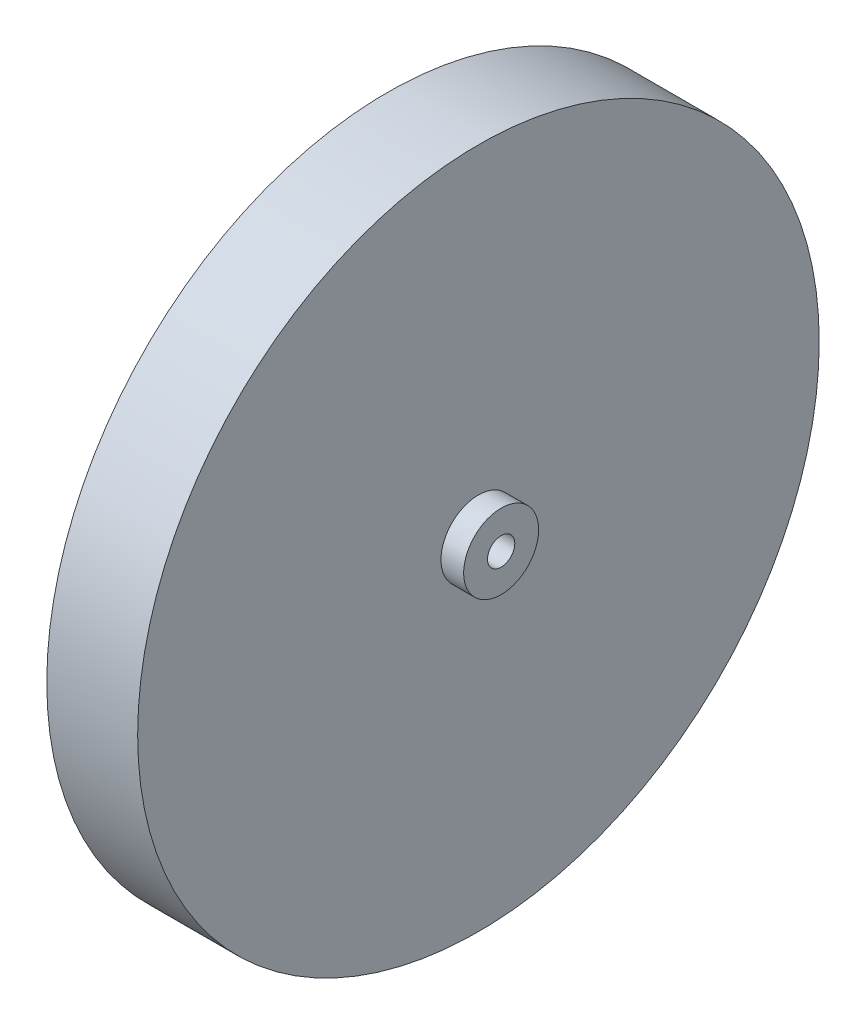
ISO-10303-21;
HEADER;
FILE_DESCRIPTION(('STEP AP214'),'2;1');
FILE_NAME('part.step','',(''),(''),'','','');
FILE_SCHEMA(('AUTOMOTIVE_DESIGN { 1 0 10303 214 1 1 1 1 }'));
ENDSEC;
DATA;
#1=APPLICATION_CONTEXT('core data for automotive mechanical design processes');
#2=APPLICATION_PROTOCOL_DEFINITION('international standard','automotive_design',2000,#1);
#3=PRODUCT_CONTEXT('',#1,'mechanical');
#4=PRODUCT('Part','Part','',(#3));
#5=PRODUCT_RELATED_PRODUCT_CATEGORY('part','',(#4));
#6=PRODUCT_DEFINITION_FORMATION('','',#4);
#7=PRODUCT_DEFINITION_CONTEXT('part definition',#1,'design');
#8=PRODUCT_DEFINITION('design','',#6,#7);
#9=PRODUCT_DEFINITION_SHAPE('','',#8);
#10=(LENGTH_UNIT() NAMED_UNIT(*) SI_UNIT(.MILLI.,.METRE.));
#11=(NAMED_UNIT(*) PLANE_ANGLE_UNIT() SI_UNIT($,.RADIAN.));
#12=(NAMED_UNIT(*) SI_UNIT($,.STERADIAN.) SOLID_ANGLE_UNIT());
#13=UNCERTAINTY_MEASURE_WITH_UNIT(LENGTH_MEASURE(1.E-05),#10,'distance_accuracy_value','');
#14=(GEOMETRIC_REPRESENTATION_CONTEXT(3) GLOBAL_UNCERTAINTY_ASSIGNED_CONTEXT((#13)) GLOBAL_UNIT_ASSIGNED_CONTEXT((#10,
#11,#12)) REPRESENTATION_CONTEXT('',''));
#15=CARTESIAN_POINT('',(0.,0.,0.));
#16=DIRECTION('',(0.,0.,1.));
#17=DIRECTION('',(1.,0.,0.));
#18=AXIS2_PLACEMENT_3D('',#15,#16,#17);
#19=CARTESIAN_POINT('',(6.35,0.,0.));
#20=DIRECTION('',(-1.,0.,0.));
#21=DIRECTION('',(0.,0.,1.));
#22=AXIS2_PLACEMENT_3D('',#19,#20,#21);
#23=PLANE('',#22);
#24=CARTESIAN_POINT('',(6.35,0.,0.));
#25=DIRECTION('',(-1.,0.,0.));
#26=DIRECTION('',(0.,0.,1.));
#27=AXIS2_PLACEMENT_3D('',#24,#25,#26);
#28=CIRCLE('',#27,12.7);
#29=CARTESIAN_POINT('',(6.35,0.,12.7));
#30=VERTEX_POINT('',#29);
#31=EDGE_CURVE('E57',#30,#30,#28,.T.);
#32=ORIENTED_EDGE('',*,*,#31,.T.);
#33=EDGE_LOOP('',(#32));
#34=FACE_BOUND('',#33,.T.);
#35=CARTESIAN_POINT('',(6.35,0.,0.));
#36=DIRECTION('',(-1.,0.,0.));
#37=DIRECTION('',(0.,0.,1.));
#38=AXIS2_PLACEMENT_3D('',#35,#36,#37);
#39=CIRCLE('',#38,6.731);
#40=CARTESIAN_POINT('',(6.35,0.,6.731));
#41=VERTEX_POINT('',#40);
#42=EDGE_CURVE('E66',#41,#41,#39,.T.);
#43=ORIENTED_EDGE('',*,*,#42,.F.);
#44=EDGE_LOOP('',(#43));
#45=FACE_BOUND('',#44,.T.);
#46=ADVANCED_FACE('F32',(#34,#45),#23,.T.);
#47=CARTESIAN_POINT('',(0.,0.,0.));
#48=DIRECTION('',(1.,0.,0.));
#49=DIRECTION('',(0.,0.,-1.));
#50=AXIS2_PLACEMENT_3D('',#47,#48,#49);
#51=CYLINDRICAL_SURFACE('',#50,1.524);
#52=CARTESIAN_POINT('',(12.7,0.,0.));
#53=DIRECTION('',(1.,0.,0.));
#54=DIRECTION('',(0.,0.,-1.));
#55=AXIS2_PLACEMENT_3D('',#52,#53,#54);
#56=CIRCLE('',#55,1.524);
#57=CARTESIAN_POINT('',(12.7,0.,-1.524));
#58=VERTEX_POINT('',#57);
#59=EDGE_CURVE('E48',#58,#58,#56,.T.);
#60=ORIENTED_EDGE('',*,*,#59,.T.);
#61=EDGE_LOOP('',(#60));
#62=FACE_BOUND('',#61,.T.);
#63=CARTESIAN_POINT('',(6.35,0.,0.));
#64=DIRECTION('',(-1.,0.,0.));
#65=DIRECTION('',(0.,0.,1.));
#66=AXIS2_PLACEMENT_3D('',#63,#64,#65);
#67=CIRCLE('',#66,1.524);
#68=CARTESIAN_POINT('',(6.35,0.,1.524));
#69=VERTEX_POINT('',#68);
#70=EDGE_CURVE('E69',#69,#69,#67,.F.);
#71=ORIENTED_EDGE('',*,*,#70,.F.);
#72=EDGE_LOOP('',(#71));
#73=FACE_BOUND('',#72,.T.);
#74=ADVANCED_FACE('F104',(#62,#73),#51,.F.);
#75=CARTESIAN_POINT('',(10.16,0.,0.));
#76=DIRECTION('',(1.,0.,0.));
#77=DIRECTION('',(0.,0.,-1.));
#78=AXIS2_PLACEMENT_3D('',#75,#76,#77);
#79=PLANE('',#78);
#80=CARTESIAN_POINT('',(10.16,0.,0.));
#81=DIRECTION('',(1.,0.,0.));
#82=DIRECTION('',(0.,0.,-1.));
#83=AXIS2_PLACEMENT_3D('',#80,#81,#82);
#84=CIRCLE('',#83,38.1);
#85=CARTESIAN_POINT('',(10.16,0.,-38.1));
#86=VERTEX_POINT('',#85);
#87=EDGE_CURVE('E10',#86,#86,#84,.T.);
#88=ORIENTED_EDGE('',*,*,#87,.T.);
#89=EDGE_LOOP('',(#88));
#90=FACE_BOUND('',#89,.T.);
#91=CARTESIAN_POINT('',(10.16,0.,0.));
#92=DIRECTION('',(1.,0.,0.));
#93=DIRECTION('',(0.,0.,-1.));
#94=AXIS2_PLACEMENT_3D('',#91,#92,#93);
#95=CIRCLE('',#94,4.191);
#96=CARTESIAN_POINT('',(10.16,0.,-4.191));
#97=VERTEX_POINT('',#96);
#98=EDGE_CURVE('E45',#97,#97,#95,.T.);
#99=ORIENTED_EDGE('',*,*,#98,.F.);
#100=EDGE_LOOP('',(#99));
#101=FACE_BOUND('',#100,.T.);
#102=ADVANCED_FACE('F110',(#90,#101),#79,.T.);
#103=CARTESIAN_POINT('',(10.16,0.,0.));
#104=DIRECTION('',(-1.,0.,0.));
#105=DIRECTION('',(0.,0.,1.));
#106=AXIS2_PLACEMENT_3D('',#103,#104,#105);
#107=CYLINDRICAL_SURFACE('',#106,38.1);
#108=ORIENTED_EDGE('',*,*,#87,.F.);
#109=EDGE_LOOP('',(#108));
#110=FACE_BOUND('',#109,.T.);
#111=CARTESIAN_POINT('',(0.,0.,0.));
#112=DIRECTION('',(1.,0.,0.));
#113=DIRECTION('',(0.,0.,-1.));
#114=AXIS2_PLACEMENT_3D('',#111,#112,#113);
#115=CIRCLE('',#114,38.1);
#116=CARTESIAN_POINT('',(0.,0.,-38.1));
#117=VERTEX_POINT('',#116);
#118=EDGE_CURVE('E36',#117,#117,#115,.T.);
#119=ORIENTED_EDGE('',*,*,#118,.T.);
#120=EDGE_LOOP('',(#119));
#121=FACE_BOUND('',#120,.T.);
#122=ADVANCED_FACE('F34',(#110,#121),#107,.T.);
#123=CARTESIAN_POINT('',(0.,0.,0.));
#124=DIRECTION('',(1.,0.,0.));
#125=DIRECTION('',(0.,0.,-1.));
#126=AXIS2_PLACEMENT_3D('',#123,#124,#125);
#127=PLANE('',#126);
#128=CARTESIAN_POINT('',(0.,0.,0.));
#129=DIRECTION('',(-1.,0.,0.));
#130=DIRECTION('',(0.,0.,1.));
#131=AXIS2_PLACEMENT_3D('',#128,#129,#130);
#132=CIRCLE('',#131,22.86);
#133=CARTESIAN_POINT('',(0.,0.,22.86));
#134=VERTEX_POINT('',#133);
#135=EDGE_CURVE('E54',#134,#134,#132,.T.);
#136=ORIENTED_EDGE('',*,*,#135,.F.);
#137=EDGE_LOOP('',(#136));
#138=FACE_BOUND('',#137,.T.);
#139=ORIENTED_EDGE('',*,*,#118,.F.);
#140=EDGE_LOOP('',(#139));
#141=FACE_BOUND('',#140,.T.);
#142=ADVANCED_FACE('F132',(#138,#141),#127,.F.);
#143=CARTESIAN_POINT('',(12.7,0.,0.));
#144=DIRECTION('',(-1.,0.,0.));
#145=DIRECTION('',(0.,0.,1.));
#146=AXIS2_PLACEMENT_3D('',#143,#144,#145);
#147=CYLINDRICAL_SURFACE('',#146,4.191);
#148=CARTESIAN_POINT('',(12.7,0.,0.));
#149=DIRECTION('',(1.,0.,0.));
#150=DIRECTION('',(0.,0.,-1.));
#151=AXIS2_PLACEMENT_3D('',#148,#149,#150);
#152=CIRCLE('',#151,4.191);
#153=CARTESIAN_POINT('',(12.7,0.,-4.191));
#154=VERTEX_POINT('',#153);
#155=EDGE_CURVE('E43',#154,#154,#152,.T.);
#156=ORIENTED_EDGE('',*,*,#155,.F.);
#157=EDGE_LOOP('',(#156));
#158=FACE_BOUND('',#157,.T.);
#159=ORIENTED_EDGE('',*,*,#98,.T.);
#160=EDGE_LOOP('',(#159));
#161=FACE_BOUND('',#160,.T.);
#162=ADVANCED_FACE('F128',(#158,#161),#147,.T.);
#163=CARTESIAN_POINT('',(12.7,0.,0.));
#164=DIRECTION('',(1.,0.,0.));
#165=DIRECTION('',(0.,0.,-1.));
#166=AXIS2_PLACEMENT_3D('',#163,#164,#165);
#167=PLANE('',#166);
#168=ORIENTED_EDGE('',*,*,#59,.F.);
#169=EDGE_LOOP('',(#168));
#170=FACE_BOUND('',#169,.T.);
#171=ORIENTED_EDGE('',*,*,#155,.T.);
#172=EDGE_LOOP('',(#171));
#173=FACE_BOUND('',#172,.T.);
#174=ADVANCED_FACE('F121',(#170,#173),#167,.T.);
#175=CARTESIAN_POINT('',(3.81,0.,0.));
#176=DIRECTION('',(-1.,0.,0.));
#177=DIRECTION('',(0.,0.,1.));
#178=AXIS2_PLACEMENT_3D('',#175,#176,#177);
#179=PLANE('',#178);
#180=CARTESIAN_POINT('',(3.81,0.,0.));
#181=DIRECTION('',(-1.,0.,0.));
#182=DIRECTION('',(0.,0.,1.));
#183=AXIS2_PLACEMENT_3D('',#180,#181,#182);
#184=CIRCLE('',#183,12.7);
#185=CARTESIAN_POINT('',(3.81,0.,12.7));
#186=VERTEX_POINT('',#185);
#187=EDGE_CURVE('E60',#186,#186,#184,.T.);
#188=ORIENTED_EDGE('',*,*,#187,.F.);
#189=EDGE_LOOP('',(#188));
#190=FACE_BOUND('',#189,.T.);
#191=CARTESIAN_POINT('',(3.81,0.,0.));
#192=DIRECTION('',(-1.,0.,0.));
#193=DIRECTION('',(0.,0.,1.));
#194=AXIS2_PLACEMENT_3D('',#191,#192,#193);
#195=CIRCLE('',#194,22.86);
#196=CARTESIAN_POINT('',(3.81,0.,22.86));
#197=VERTEX_POINT('',#196);
#198=EDGE_CURVE('E53',#197,#197,#195,.T.);
#199=ORIENTED_EDGE('',*,*,#198,.T.);
#200=EDGE_LOOP('',(#199));
#201=FACE_BOUND('',#200,.T.);
#202=ADVANCED_FACE('F118',(#190,#201),#179,.T.);
#203=CARTESIAN_POINT('',(3.81,0.,0.));
#204=DIRECTION('',(-1.,0.,0.));
#205=DIRECTION('',(0.,0.,1.));
#206=AXIS2_PLACEMENT_3D('',#203,#204,#205);
#207=CYLINDRICAL_SURFACE('',#206,22.86);
#208=ORIENTED_EDGE('',*,*,#198,.F.);
#209=EDGE_LOOP('',(#208));
#210=FACE_BOUND('',#209,.T.);
#211=ORIENTED_EDGE('',*,*,#135,.T.);
#212=EDGE_LOOP('',(#211));
#213=FACE_BOUND('',#212,.T.);
#214=ADVANCED_FACE('F116',(#210,#213),#207,.F.);
#215=CARTESIAN_POINT('',(6.35,0.,0.));
#216=DIRECTION('',(-1.,0.,0.));
#217=DIRECTION('',(0.,0.,1.));
#218=AXIS2_PLACEMENT_3D('',#215,#216,#217);
#219=CYLINDRICAL_SURFACE('',#218,12.7);
#220=ORIENTED_EDGE('',*,*,#31,.F.);
#221=EDGE_LOOP('',(#220));
#222=FACE_BOUND('',#221,.T.);
#223=ORIENTED_EDGE('',*,*,#187,.T.);
#224=EDGE_LOOP('',(#223));
#225=FACE_BOUND('',#224,.T.);
#226=ADVANCED_FACE('F94',(#222,#225),#219,.F.);
#227=CARTESIAN_POINT('',(2.54,0.,0.));
#228=DIRECTION('',(-1.,0.,0.));
#229=DIRECTION('',(0.,0.,1.));
#230=AXIS2_PLACEMENT_3D('',#227,#228,#229);
#231=PLANE('',#230);
#232=CARTESIAN_POINT('',(2.54,0.,0.));
#233=DIRECTION('',(-1.,0.,0.));
#234=DIRECTION('',(0.,0.,1.));
#235=AXIS2_PLACEMENT_3D('',#232,#233,#234);
#236=CIRCLE('',#235,3.81);
#237=CARTESIAN_POINT('',(2.54,0.,3.81));
#238=VERTEX_POINT('',#237);
#239=EDGE_CURVE('E75',#238,#238,#236,.T.);
#240=ORIENTED_EDGE('',*,*,#239,.F.);
#241=EDGE_LOOP('',(#240));
#242=FACE_BOUND('',#241,.T.);
#243=CARTESIAN_POINT('',(2.54,0.,0.));
#244=DIRECTION('',(-1.,0.,0.));
#245=DIRECTION('',(0.,0.,1.));
#246=AXIS2_PLACEMENT_3D('',#243,#244,#245);
#247=CIRCLE('',#246,6.731);
#248=CARTESIAN_POINT('',(2.54,0.,6.731));
#249=VERTEX_POINT('',#248);
#250=EDGE_CURVE('E63',#249,#249,#247,.T.);
#251=ORIENTED_EDGE('',*,*,#250,.T.);
#252=EDGE_LOOP('',(#251));
#253=FACE_BOUND('',#252,.T.);
#254=ADVANCED_FACE('F90',(#242,#253),#231,.T.);
#255=CARTESIAN_POINT('',(2.54,0.,0.));
#256=DIRECTION('',(1.,0.,0.));
#257=DIRECTION('',(0.,0.,-1.));
#258=AXIS2_PLACEMENT_3D('',#255,#256,#257);
#259=CYLINDRICAL_SURFACE('',#258,6.731);
#260=ORIENTED_EDGE('',*,*,#250,.F.);
#261=EDGE_LOOP('',(#260));
#262=FACE_BOUND('',#261,.T.);
#263=ORIENTED_EDGE('',*,*,#42,.T.);
#264=EDGE_LOOP('',(#263));
#265=FACE_BOUND('',#264,.T.);
#266=ADVANCED_FACE('F93',(#262,#265),#259,.T.);
#267=CARTESIAN_POINT('',(6.35,0.,0.));
#268=DIRECTION('',(-1.,0.,0.));
#269=DIRECTION('',(0.,0.,1.));
#270=AXIS2_PLACEMENT_3D('',#267,#268,#269);
#271=PLANE('',#270);
#272=CARTESIAN_POINT('',(6.35,0.,0.));
#273=DIRECTION('',(-1.,0.,0.));
#274=DIRECTION('',(0.,0.,1.));
#275=AXIS2_PLACEMENT_3D('',#272,#273,#274);
#276=CIRCLE('',#275,3.81);
#277=CARTESIAN_POINT('',(6.35,0.,3.81));
#278=VERTEX_POINT('',#277);
#279=EDGE_CURVE('E74',#278,#278,#276,.T.);
#280=ORIENTED_EDGE('',*,*,#279,.T.);
#281=EDGE_LOOP('',(#280));
#282=FACE_BOUND('',#281,.T.);
#283=ORIENTED_EDGE('',*,*,#70,.T.);
#284=EDGE_LOOP('',(#283));
#285=FACE_BOUND('',#284,.T.);
#286=ADVANCED_FACE('F81',(#282,#285),#271,.T.);
#287=CARTESIAN_POINT('',(6.35,0.,0.));
#288=DIRECTION('',(-1.,0.,0.));
#289=DIRECTION('',(0.,0.,1.));
#290=AXIS2_PLACEMENT_3D('',#287,#288,#289);
#291=CYLINDRICAL_SURFACE('',#290,3.81);
#292=ORIENTED_EDGE('',*,*,#279,.F.);
#293=EDGE_LOOP('',(#292));
#294=FACE_BOUND('',#293,.T.);
#295=ORIENTED_EDGE('',*,*,#239,.T.);
#296=EDGE_LOOP('',(#295));
#297=FACE_BOUND('',#296,.T.);
#298=ADVANCED_FACE('F84',(#294,#297),#291,.F.);
#299=CLOSED_SHELL('',(#46,#74,#102,#122,#142,#162,#174,#202,#214,#226,#254,#266,#286,#298));
#300=MANIFOLD_SOLID_BREP('B2',#299);
#301=ADVANCED_BREP_SHAPE_REPRESENTATION('',(#18,#300),#14);
#302=SHAPE_DEFINITION_REPRESENTATION(#9,#301);
ENDSEC;
END-ISO-10303-21;
